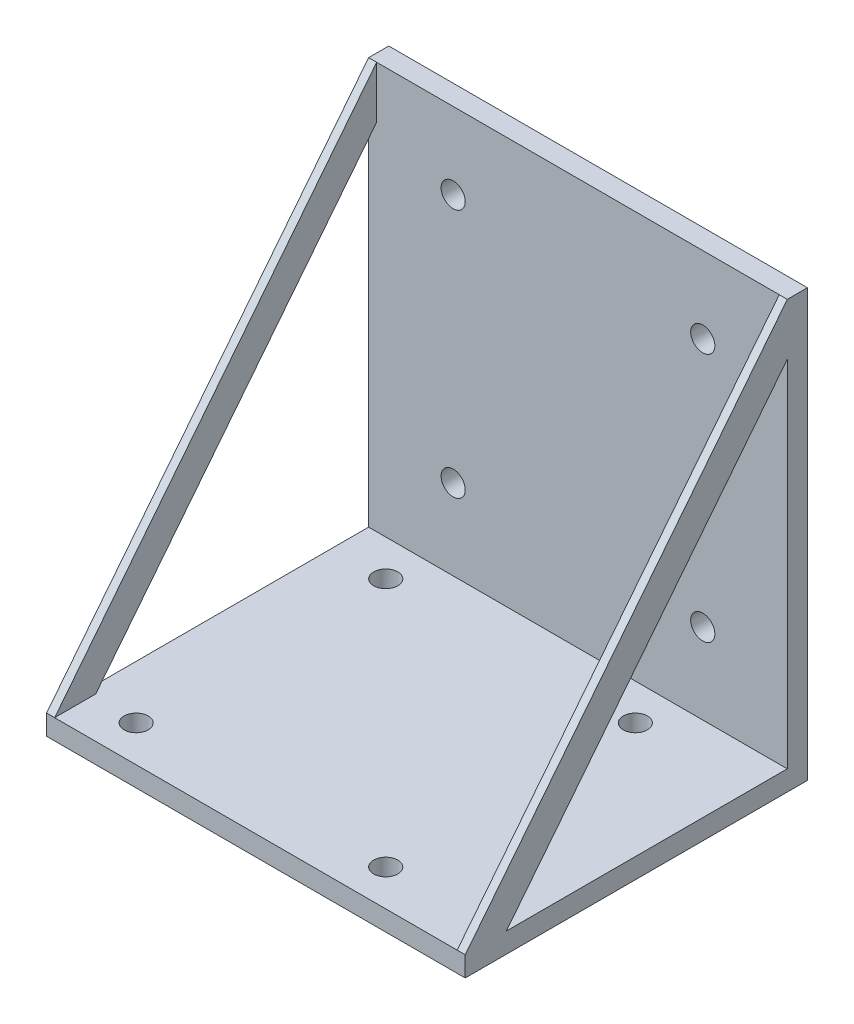
ISO-10303-21;
HEADER;
FILE_DESCRIPTION(('STEP AP214'),'2;1');
FILE_NAME('part.step','',(''),(''),'','','');
FILE_SCHEMA(('AUTOMOTIVE_DESIGN { 1 0 10303 214 1 1 1 1 }'));
ENDSEC;
DATA;
#1=APPLICATION_CONTEXT('core data for automotive mechanical design processes');
#2=APPLICATION_PROTOCOL_DEFINITION('international standard','automotive_design',2000,#1);
#3=PRODUCT_CONTEXT('',#1,'mechanical');
#4=PRODUCT('Part','Part','',(#3));
#5=PRODUCT_RELATED_PRODUCT_CATEGORY('part','',(#4));
#6=PRODUCT_DEFINITION_FORMATION('','',#4);
#7=PRODUCT_DEFINITION_CONTEXT('part definition',#1,'design');
#8=PRODUCT_DEFINITION('design','',#6,#7);
#9=PRODUCT_DEFINITION_SHAPE('','',#8);
#10=(LENGTH_UNIT() NAMED_UNIT(*) SI_UNIT(.MILLI.,.METRE.));
#11=(NAMED_UNIT(*) PLANE_ANGLE_UNIT() SI_UNIT($,.RADIAN.));
#12=(NAMED_UNIT(*) SI_UNIT($,.STERADIAN.) SOLID_ANGLE_UNIT());
#13=UNCERTAINTY_MEASURE_WITH_UNIT(LENGTH_MEASURE(1.E-05),#10,'distance_accuracy_value','');
#14=(GEOMETRIC_REPRESENTATION_CONTEXT(3) GLOBAL_UNCERTAINTY_ASSIGNED_CONTEXT((#13)) GLOBAL_UNIT_ASSIGNED_CONTEXT((#10,
#11,#12)) REPRESENTATION_CONTEXT('',''));
#15=CARTESIAN_POINT('',(0.,0.,0.));
#16=DIRECTION('',(0.,0.,1.));
#17=DIRECTION('',(1.,0.,0.));
#18=AXIS2_PLACEMENT_3D('',#15,#16,#17);
#19=CARTESIAN_POINT('',(0.,0.,2.5));
#20=DIRECTION('',(0.,0.,-1.));
#21=DIRECTION('',(-1.,0.,0.));
#22=AXIS2_PLACEMENT_3D('',#19,#20,#21);
#23=PLANE('',#22);
#24=CARTESIAN_POINT('',(-15.4999999999997,-15.5,2.5));
#25=DIRECTION('',(0.,0.,1.));
#26=DIRECTION('',(1.,0.,0.));
#27=AXIS2_PLACEMENT_3D('',#24,#25,#26);
#28=CIRCLE('',#27,1.5);
#29=CARTESIAN_POINT('',(-13.9999999999997,-15.5,2.5));
#30=VERTEX_POINT('',#29);
#31=EDGE_CURVE('E169',#30,#30,#28,.T.);
#32=ORIENTED_EDGE('',*,*,#31,.F.);
#33=EDGE_LOOP('',(#32));
#34=FACE_BOUND('',#33,.T.);
#35=CARTESIAN_POINT('',(15.5000000000003,-15.5,2.5));
#36=DIRECTION('',(0.,0.,1.));
#37=DIRECTION('',(1.,0.,0.));
#38=AXIS2_PLACEMENT_3D('',#35,#36,#37);
#39=CIRCLE('',#38,1.5);
#40=CARTESIAN_POINT('',(17.0000000000003,-15.5,2.5));
#41=VERTEX_POINT('',#40);
#42=EDGE_CURVE('E175',#41,#41,#39,.T.);
#43=ORIENTED_EDGE('',*,*,#42,.F.);
#44=EDGE_LOOP('',(#43));
#45=FACE_BOUND('',#44,.T.);
#46=CARTESIAN_POINT('',(15.5,15.5,2.5));
#47=DIRECTION('',(0.,0.,1.));
#48=DIRECTION('',(1.,0.,0.));
#49=AXIS2_PLACEMENT_3D('',#46,#47,#48);
#50=CIRCLE('',#49,1.5);
#51=CARTESIAN_POINT('',(17.,15.5,2.5));
#52=VERTEX_POINT('',#51);
#53=EDGE_CURVE('E181',#52,#52,#50,.T.);
#54=ORIENTED_EDGE('',*,*,#53,.F.);
#55=EDGE_LOOP('',(#54));
#56=FACE_BOUND('',#55,.T.);
#57=CARTESIAN_POINT('',(-15.5,15.5,2.5));
#58=DIRECTION('',(0.,0.,1.));
#59=DIRECTION('',(1.,0.,0.));
#60=AXIS2_PLACEMENT_3D('',#57,#58,#59);
#61=CIRCLE('',#60,1.5);
#62=CARTESIAN_POINT('',(-14.,15.5,2.5));
#63=VERTEX_POINT('',#62);
#64=EDGE_CURVE('E111',#63,#63,#61,.T.);
#65=ORIENTED_EDGE('',*,*,#64,.F.);
#66=EDGE_LOOP('',(#65));
#67=FACE_BOUND('',#66,.T.);
#68=DIRECTION('',(-1.,0.,0.));
#69=VECTOR('',#68,1.);
#70=CARTESIAN_POINT('',(-25.,-25.5,2.5));
#71=LINE('',#70,#69);
#72=CARTESIAN_POINT('',(26.,-25.5,2.5));
#73=VERTEX_POINT('',#72);
#74=CARTESIAN_POINT('',(-26.,-25.5,2.5));
#75=VERTEX_POINT('',#74);
#76=EDGE_CURVE('E157',#73,#75,#71,.T.);
#77=ORIENTED_EDGE('',*,*,#76,.F.);
#78=DIRECTION('',(0.,1.,0.));
#79=VECTOR('',#78,1.);
#80=CARTESIAN_POINT('',(26.,18.5577566019282,2.5));
#81=LINE('',#80,#79);
#82=CARTESIAN_POINT('',(26.,18.5577566019282,2.5));
#83=VERTEX_POINT('',#82);
#84=EDGE_CURVE('E237',#73,#83,#81,.T.);
#85=ORIENTED_EDGE('',*,*,#84,.T.);
#86=DIRECTION('',(-1.,0.,0.));
#87=VECTOR('',#86,1.);
#88=CARTESIAN_POINT('',(26.,18.5577566019282,2.5));
#89=LINE('',#88,#87);
#90=CARTESIAN_POINT('',(25.,18.5577566019282,2.5));
#91=VERTEX_POINT('',#90);
#92=EDGE_CURVE('E129',#83,#91,#89,.T.);
#93=ORIENTED_EDGE('',*,*,#92,.T.);
#94=DIRECTION('',(0.,1.,0.));
#95=VECTOR('',#94,1.);
#96=CARTESIAN_POINT('',(25.,-25.,2.5));
#97=LINE('',#96,#95);
#98=CARTESIAN_POINT('',(25.,25.,2.5));
#99=VERTEX_POINT('',#98);
#100=EDGE_CURVE('E191',#91,#99,#97,.T.);
#101=ORIENTED_EDGE('',*,*,#100,.T.);
#102=DIRECTION('',(-1.,0.,0.));
#103=VECTOR('',#102,1.);
#104=CARTESIAN_POINT('',(-25.,25.,2.5));
#105=LINE('',#104,#103);
#106=CARTESIAN_POINT('',(-25.,25.,2.5));
#107=VERTEX_POINT('',#106);
#108=EDGE_CURVE('E45',#99,#107,#105,.T.);
#109=ORIENTED_EDGE('',*,*,#108,.T.);
#110=DIRECTION('',(0.,-1.,0.));
#111=VECTOR('',#110,1.);
#112=CARTESIAN_POINT('',(-25.,-25.,2.5));
#113=LINE('',#112,#111);
#114=CARTESIAN_POINT('',(-25.,18.5577566019282,2.5));
#115=VERTEX_POINT('',#114);
#116=EDGE_CURVE('E11',#107,#115,#113,.T.);
#117=ORIENTED_EDGE('',*,*,#116,.T.);
#118=DIRECTION('',(1.,0.,0.));
#119=VECTOR('',#118,1.);
#120=CARTESIAN_POINT('',(-26.,18.5577566019282,2.5));
#121=LINE('',#120,#119);
#122=CARTESIAN_POINT('',(-26.,18.5577566019282,2.5));
#123=VERTEX_POINT('',#122);
#124=EDGE_CURVE('E230',#123,#115,#121,.T.);
#125=ORIENTED_EDGE('',*,*,#124,.F.);
#126=DIRECTION('',(0.,1.,0.));
#127=VECTOR('',#126,1.);
#128=CARTESIAN_POINT('',(-26.,18.5577566019282,2.5));
#129=LINE('',#128,#127);
#130=EDGE_CURVE('E341',#75,#123,#129,.T.);
#131=ORIENTED_EDGE('',*,*,#130,.F.);
#132=EDGE_LOOP('',(#77,#85,#93,#101,#109,#117,#125,#131));
#133=FACE_BOUND('',#132,.T.);
#134=ADVANCED_FACE('F36',(#34,#45,#56,#67,#133),#23,.F.);
#135=CARTESIAN_POINT('',(0.,0.,0.));
#136=DIRECTION('',(0.,0.,-1.));
#137=DIRECTION('',(-1.,0.,0.));
#138=AXIS2_PLACEMENT_3D('',#135,#136,#137);
#139=PLANE('',#138);
#140=CARTESIAN_POINT('',(15.5000000000003,-15.5,0.));
#141=DIRECTION('',(0.,0.,1.));
#142=DIRECTION('',(1.,0.,0.));
#143=AXIS2_PLACEMENT_3D('',#140,#141,#142);
#144=CIRCLE('',#143,1.5);
#145=CARTESIAN_POINT('',(17.0000000000003,-15.5,0.));
#146=VERTEX_POINT('',#145);
#147=EDGE_CURVE('E172',#146,#146,#144,.T.);
#148=ORIENTED_EDGE('',*,*,#147,.T.);
#149=EDGE_LOOP('',(#148));
#150=FACE_BOUND('',#149,.T.);
#151=CARTESIAN_POINT('',(-15.5,15.5,0.));
#152=DIRECTION('',(0.,0.,1.));
#153=DIRECTION('',(1.,0.,0.));
#154=AXIS2_PLACEMENT_3D('',#151,#152,#153);
#155=CIRCLE('',#154,1.5);
#156=CARTESIAN_POINT('',(-14.,15.5,0.));
#157=VERTEX_POINT('',#156);
#158=EDGE_CURVE('E184',#157,#157,#155,.T.);
#159=ORIENTED_EDGE('',*,*,#158,.T.);
#160=EDGE_LOOP('',(#159));
#161=FACE_BOUND('',#160,.T.);
#162=DIRECTION('',(-1.,0.,0.));
#163=VECTOR('',#162,1.);
#164=CARTESIAN_POINT('',(-25.,25.,0.));
#165=LINE('',#164,#163);
#166=CARTESIAN_POINT('',(26.,25.,0.));
#167=VERTEX_POINT('',#166);
#168=CARTESIAN_POINT('',(-26.,25.,0.));
#169=VERTEX_POINT('',#168);
#170=EDGE_CURVE('E98',#167,#169,#165,.T.);
#171=ORIENTED_EDGE('',*,*,#170,.F.);
#172=DIRECTION('',(0.,1.,0.));
#173=VECTOR('',#172,1.);
#174=CARTESIAN_POINT('',(26.,-28.,0.));
#175=LINE('',#174,#173);
#176=CARTESIAN_POINT('',(26.,-28.,0.));
#177=VERTEX_POINT('',#176);
#178=EDGE_CURVE('E103',#177,#167,#175,.T.);
#179=ORIENTED_EDGE('',*,*,#178,.F.);
#180=DIRECTION('',(1.,0.,0.));
#181=VECTOR('',#180,1.);
#182=CARTESIAN_POINT('',(-25.,-28.,0.));
#183=LINE('',#182,#181);
#184=CARTESIAN_POINT('',(-26.,-28.,0.));
#185=VERTEX_POINT('',#184);
#186=EDGE_CURVE('E40',#185,#177,#183,.T.);
#187=ORIENTED_EDGE('',*,*,#186,.F.);
#188=DIRECTION('',(0.,1.,0.));
#189=VECTOR('',#188,1.);
#190=CARTESIAN_POINT('',(-26.,25.,0.));
#191=LINE('',#190,#189);
#192=EDGE_CURVE('E106',#185,#169,#191,.T.);
#193=ORIENTED_EDGE('',*,*,#192,.T.);
#194=EDGE_LOOP('',(#171,#179,#187,#193));
#195=FACE_BOUND('',#194,.T.);
#196=CARTESIAN_POINT('',(15.5,15.5,0.));
#197=DIRECTION('',(0.,0.,1.));
#198=DIRECTION('',(1.,0.,0.));
#199=AXIS2_PLACEMENT_3D('',#196,#197,#198);
#200=CIRCLE('',#199,1.5);
#201=CARTESIAN_POINT('',(17.,15.5,0.));
#202=VERTEX_POINT('',#201);
#203=EDGE_CURVE('E178',#202,#202,#200,.T.);
#204=ORIENTED_EDGE('',*,*,#203,.T.);
#205=EDGE_LOOP('',(#204));
#206=FACE_BOUND('',#205,.T.);
#207=CARTESIAN_POINT('',(-15.4999999999997,-15.5,0.));
#208=DIRECTION('',(0.,0.,1.));
#209=DIRECTION('',(1.,0.,0.));
#210=AXIS2_PLACEMENT_3D('',#207,#208,#209);
#211=CIRCLE('',#210,1.5);
#212=CARTESIAN_POINT('',(-13.9999999999997,-15.5,0.));
#213=VERTEX_POINT('',#212);
#214=EDGE_CURVE('E168',#213,#213,#211,.T.);
#215=ORIENTED_EDGE('',*,*,#214,.T.);
#216=EDGE_LOOP('',(#215));
#217=FACE_BOUND('',#216,.T.);
#218=ADVANCED_FACE('F100',(#150,#161,#195,#206,#217),#139,.T.);
#219=CARTESIAN_POINT('',(-25.,25.,2.5));
#220=DIRECTION('',(0.,-1.,0.));
#221=DIRECTION('',(0.,0.,-1.));
#222=AXIS2_PLACEMENT_3D('',#219,#220,#221);
#223=PLANE('',#222);
#224=ORIENTED_EDGE('',*,*,#170,.T.);
#225=DIRECTION('',(0.,0.,1.));
#226=VECTOR('',#225,1.);
#227=CARTESIAN_POINT('',(-26.,25.,2.5));
#228=LINE('',#227,#226);
#229=CARTESIAN_POINT('',(-26.,25.,2.5));
#230=VERTEX_POINT('',#229);
#231=EDGE_CURVE('E211',#169,#230,#228,.T.);
#232=ORIENTED_EDGE('',*,*,#231,.T.);
#233=DIRECTION('',(1.,0.,0.));
#234=VECTOR('',#233,1.);
#235=CARTESIAN_POINT('',(-26.,25.,2.5));
#236=LINE('',#235,#234);
#237=EDGE_CURVE('E208',#230,#107,#236,.T.);
#238=ORIENTED_EDGE('',*,*,#237,.T.);
#239=ORIENTED_EDGE('',*,*,#108,.F.);
#240=DIRECTION('',(-1.,0.,0.));
#241=VECTOR('',#240,1.);
#242=CARTESIAN_POINT('',(26.,25.,2.5));
#243=LINE('',#242,#241);
#244=CARTESIAN_POINT('',(26.,25.,2.5));
#245=VERTEX_POINT('',#244);
#246=EDGE_CURVE('E120',#245,#99,#243,.T.);
#247=ORIENTED_EDGE('',*,*,#246,.F.);
#248=DIRECTION('',(0.,0.,1.));
#249=VECTOR('',#248,1.);
#250=CARTESIAN_POINT('',(26.,25.,2.5));
#251=LINE('',#250,#249);
#252=EDGE_CURVE('E115',#167,#245,#251,.T.);
#253=ORIENTED_EDGE('',*,*,#252,.F.);
#254=EDGE_LOOP('',(#224,#232,#238,#239,#247,#253));
#255=FACE_BOUND('',#254,.T.);
#256=ADVANCED_FACE('F38',(#255),#223,.F.);
#257=CARTESIAN_POINT('',(-25.,-28.,2.5));
#258=DIRECTION('',(0.,1.,0.));
#259=DIRECTION('',(0.,0.,1.));
#260=AXIS2_PLACEMENT_3D('',#257,#258,#259);
#261=PLANE('',#260);
#262=CARTESIAN_POINT('',(11.625,-28.,7.));
#263=DIRECTION('',(0.,1.,0.));
#264=DIRECTION('',(0.,0.,1.));
#265=AXIS2_PLACEMENT_3D('',#262,#263,#264);
#266=CIRCLE('',#265,1.5);
#267=CARTESIAN_POINT('',(11.625,-28.,8.5));
#268=VERTEX_POINT('',#267);
#269=EDGE_CURVE('E148',#268,#268,#266,.T.);
#270=ORIENTED_EDGE('',*,*,#269,.T.);
#271=EDGE_LOOP('',(#270));
#272=FACE_BOUND('',#271,.T.);
#273=CARTESIAN_POINT('',(11.6250000000003,-28.,38.));
#274=DIRECTION('',(0.,1.,0.));
#275=DIRECTION('',(0.,0.,1.));
#276=AXIS2_PLACEMENT_3D('',#273,#274,#275);
#277=CIRCLE('',#276,1.5);
#278=CARTESIAN_POINT('',(11.6250000000003,-28.,39.5));
#279=VERTEX_POINT('',#278);
#280=EDGE_CURVE('E145',#279,#279,#277,.T.);
#281=ORIENTED_EDGE('',*,*,#280,.T.);
#282=EDGE_LOOP('',(#281));
#283=FACE_BOUND('',#282,.T.);
#284=CARTESIAN_POINT('',(-19.3749999999997,-28.,38.));
#285=DIRECTION('',(0.,1.,0.));
#286=DIRECTION('',(0.,0.,1.));
#287=AXIS2_PLACEMENT_3D('',#284,#285,#286);
#288=CIRCLE('',#287,1.5);
#289=CARTESIAN_POINT('',(-19.3749999999997,-28.,39.5));
#290=VERTEX_POINT('',#289);
#291=EDGE_CURVE('E137',#290,#290,#288,.T.);
#292=ORIENTED_EDGE('',*,*,#291,.T.);
#293=EDGE_LOOP('',(#292));
#294=FACE_BOUND('',#293,.T.);
#295=CARTESIAN_POINT('',(-19.375,-28.,7.));
#296=DIRECTION('',(0.,1.,0.));
#297=DIRECTION('',(0.,0.,1.));
#298=AXIS2_PLACEMENT_3D('',#295,#296,#297);
#299=CIRCLE('',#298,1.5);
#300=CARTESIAN_POINT('',(-19.375,-28.,8.5));
#301=VERTEX_POINT('',#300);
#302=EDGE_CURVE('E154',#301,#301,#299,.T.);
#303=ORIENTED_EDGE('',*,*,#302,.T.);
#304=EDGE_LOOP('',(#303));
#305=FACE_BOUND('',#304,.T.);
#306=ORIENTED_EDGE('',*,*,#186,.T.);
#307=DIRECTION('',(0.,0.,-1.));
#308=VECTOR('',#307,1.);
#309=CARTESIAN_POINT('',(26.,-28.,39.3431457505076));
#310=LINE('',#309,#308);
#311=CARTESIAN_POINT('',(26.,-28.,42.5));
#312=VERTEX_POINT('',#311);
#313=EDGE_CURVE('E117',#312,#177,#310,.T.);
#314=ORIENTED_EDGE('',*,*,#313,.F.);
#315=DIRECTION('',(1.,0.,0.));
#316=VECTOR('',#315,1.);
#317=CARTESIAN_POINT('',(-25.,-28.,42.5));
#318=LINE('',#317,#316);
#319=CARTESIAN_POINT('',(-26.,-28.,42.5));
#320=VERTEX_POINT('',#319);
#321=EDGE_CURVE('E86',#320,#312,#318,.T.);
#322=ORIENTED_EDGE('',*,*,#321,.F.);
#323=DIRECTION('',(0.,0.,-1.));
#324=VECTOR('',#323,1.);
#325=CARTESIAN_POINT('',(-26.,-28.,39.3431457505076));
#326=LINE('',#325,#324);
#327=EDGE_CURVE('E216',#320,#185,#326,.T.);
#328=ORIENTED_EDGE('',*,*,#327,.T.);
#329=EDGE_LOOP('',(#306,#314,#322,#328));
#330=FACE_BOUND('',#329,.T.);
#331=ADVANCED_FACE('F313',(#272,#283,#294,#305,#330),#261,.F.);
#332=CARTESIAN_POINT('',(-15.5,15.5,2.5));
#333=DIRECTION('',(0.,0.,-1.));
#334=DIRECTION('',(-1.,0.,0.));
#335=AXIS2_PLACEMENT_3D('',#332,#333,#334);
#336=CYLINDRICAL_SURFACE('',#335,1.5);
#337=ORIENTED_EDGE('',*,*,#64,.T.);
#338=EDGE_LOOP('',(#337));
#339=FACE_BOUND('',#338,.T.);
#340=ORIENTED_EDGE('',*,*,#158,.F.);
#341=EDGE_LOOP('',(#340));
#342=FACE_BOUND('',#341,.T.);
#343=ADVANCED_FACE('F311',(#339,#342),#336,.F.);
#344=CARTESIAN_POINT('',(15.5,15.5,2.5));
#345=DIRECTION('',(0.,0.,-1.));
#346=DIRECTION('',(-1.,0.,0.));
#347=AXIS2_PLACEMENT_3D('',#344,#345,#346);
#348=CYLINDRICAL_SURFACE('',#347,1.5);
#349=ORIENTED_EDGE('',*,*,#53,.T.);
#350=EDGE_LOOP('',(#349));
#351=FACE_BOUND('',#350,.T.);
#352=ORIENTED_EDGE('',*,*,#203,.F.);
#353=EDGE_LOOP('',(#352));
#354=FACE_BOUND('',#353,.T.);
#355=ADVANCED_FACE('F320',(#351,#354),#348,.F.);
#356=CARTESIAN_POINT('',(15.5000000000003,-15.5,2.5));
#357=DIRECTION('',(0.,0.,-1.));
#358=DIRECTION('',(-1.,0.,0.));
#359=AXIS2_PLACEMENT_3D('',#356,#357,#358);
#360=CYLINDRICAL_SURFACE('',#359,1.5);
#361=ORIENTED_EDGE('',*,*,#42,.T.);
#362=EDGE_LOOP('',(#361));
#363=FACE_BOUND('',#362,.T.);
#364=ORIENTED_EDGE('',*,*,#147,.F.);
#365=EDGE_LOOP('',(#364));
#366=FACE_BOUND('',#365,.T.);
#367=ADVANCED_FACE('F390',(#363,#366),#360,.F.);
#368=CARTESIAN_POINT('',(-15.4999999999997,-15.5,2.5));
#369=DIRECTION('',(0.,0.,-1.));
#370=DIRECTION('',(-1.,0.,0.));
#371=AXIS2_PLACEMENT_3D('',#368,#369,#370);
#372=CYLINDRICAL_SURFACE('',#371,1.5);
#373=ORIENTED_EDGE('',*,*,#31,.T.);
#374=EDGE_LOOP('',(#373));
#375=FACE_BOUND('',#374,.T.);
#376=ORIENTED_EDGE('',*,*,#214,.F.);
#377=EDGE_LOOP('',(#376));
#378=FACE_BOUND('',#377,.T.);
#379=ADVANCED_FACE('F386',(#375,#378),#372,.F.);
#380=CARTESIAN_POINT('',(-25.,-25.5,42.5));
#381=DIRECTION('',(0.,-1.,0.));
#382=DIRECTION('',(0.,0.,-1.));
#383=AXIS2_PLACEMENT_3D('',#380,#381,#382);
#384=PLANE('',#383);
#385=CARTESIAN_POINT('',(11.625,-25.5,7.));
#386=DIRECTION('',(0.,1.,0.));
#387=DIRECTION('',(0.,0.,1.));
#388=AXIS2_PLACEMENT_3D('',#385,#386,#387);
#389=CIRCLE('',#388,1.5);
#390=CARTESIAN_POINT('',(11.625,-25.5,8.5));
#391=VERTEX_POINT('',#390);
#392=EDGE_CURVE('E134',#391,#391,#389,.T.);
#393=ORIENTED_EDGE('',*,*,#392,.F.);
#394=EDGE_LOOP('',(#393));
#395=FACE_BOUND('',#394,.T.);
#396=CARTESIAN_POINT('',(11.6250000000003,-25.5,38.));
#397=DIRECTION('',(0.,1.,0.));
#398=DIRECTION('',(0.,0.,1.));
#399=AXIS2_PLACEMENT_3D('',#396,#397,#398);
#400=CIRCLE('',#399,1.5);
#401=CARTESIAN_POINT('',(11.6250000000003,-25.5,39.5));
#402=VERTEX_POINT('',#401);
#403=EDGE_CURVE('E138',#402,#402,#400,.T.);
#404=ORIENTED_EDGE('',*,*,#403,.F.);
#405=EDGE_LOOP('',(#404));
#406=FACE_BOUND('',#405,.T.);
#407=CARTESIAN_POINT('',(-19.3749999999997,-25.5,38.));
#408=DIRECTION('',(0.,1.,0.));
#409=DIRECTION('',(0.,0.,1.));
#410=AXIS2_PLACEMENT_3D('',#407,#408,#409);
#411=CIRCLE('',#410,1.5);
#412=CARTESIAN_POINT('',(-19.3749999999997,-25.5,39.5));
#413=VERTEX_POINT('',#412);
#414=EDGE_CURVE('E133',#413,#413,#411,.T.);
#415=ORIENTED_EDGE('',*,*,#414,.F.);
#416=EDGE_LOOP('',(#415));
#417=FACE_BOUND('',#416,.T.);
#418=CARTESIAN_POINT('',(-19.375,-25.5,7.));
#419=DIRECTION('',(0.,1.,0.));
#420=DIRECTION('',(0.,0.,1.));
#421=AXIS2_PLACEMENT_3D('',#418,#419,#420);
#422=CIRCLE('',#421,1.5);
#423=CARTESIAN_POINT('',(-19.375,-25.5,8.5));
#424=VERTEX_POINT('',#423);
#425=EDGE_CURVE('E151',#424,#424,#422,.T.);
#426=ORIENTED_EDGE('',*,*,#425,.F.);
#427=EDGE_LOOP('',(#426));
#428=FACE_BOUND('',#427,.T.);
#429=ORIENTED_EDGE('',*,*,#76,.T.);
#430=DIRECTION('',(0.,0.,-1.));
#431=VECTOR('',#430,1.);
#432=CARTESIAN_POINT('',(-26.,-25.5,2.5));
#433=LINE('',#432,#431);
#434=CARTESIAN_POINT('',(-26.,-25.5,37.3972329520223));
#435=VERTEX_POINT('',#434);
#436=EDGE_CURVE('E344',#435,#75,#433,.T.);
#437=ORIENTED_EDGE('',*,*,#436,.F.);
#438=DIRECTION('',(1.,0.,0.));
#439=VECTOR('',#438,1.);
#440=CARTESIAN_POINT('',(-26.,-25.5,37.3972329520223));
#441=LINE('',#440,#439);
#442=CARTESIAN_POINT('',(-25.,-25.5,37.3972329520223));
#443=VERTEX_POINT('',#442);
#444=EDGE_CURVE('E225',#435,#443,#441,.T.);
#445=ORIENTED_EDGE('',*,*,#444,.T.);
#446=DIRECTION('',(0.,0.,-1.));
#447=VECTOR('',#446,1.);
#448=CARTESIAN_POINT('',(-25.,-25.5,42.5));
#449=LINE('',#448,#447);
#450=CARTESIAN_POINT('',(-25.,-25.5,42.5));
#451=VERTEX_POINT('',#450);
#452=EDGE_CURVE('E162',#451,#443,#449,.T.);
#453=ORIENTED_EDGE('',*,*,#452,.F.);
#454=DIRECTION('',(-1.,0.,0.));
#455=VECTOR('',#454,1.);
#456=CARTESIAN_POINT('',(-25.,-25.5,42.5));
#457=LINE('',#456,#455);
#458=CARTESIAN_POINT('',(25.,-25.5,42.5));
#459=VERTEX_POINT('',#458);
#460=EDGE_CURVE('E159',#459,#451,#457,.T.);
#461=ORIENTED_EDGE('',*,*,#460,.F.);
#462=DIRECTION('',(0.,0.,-1.));
#463=VECTOR('',#462,1.);
#464=CARTESIAN_POINT('',(25.,-25.5,42.5));
#465=LINE('',#464,#463);
#466=CARTESIAN_POINT('',(25.,-25.5,37.3972329520223));
#467=VERTEX_POINT('',#466);
#468=EDGE_CURVE('E77',#459,#467,#465,.T.);
#469=ORIENTED_EDGE('',*,*,#468,.T.);
#470=DIRECTION('',(-1.,0.,0.));
#471=VECTOR('',#470,1.);
#472=CARTESIAN_POINT('',(26.,-25.5,37.3972329520223));
#473=LINE('',#472,#471);
#474=CARTESIAN_POINT('',(26.,-25.5,37.3972329520223));
#475=VERTEX_POINT('',#474);
#476=EDGE_CURVE('E53',#475,#467,#473,.T.);
#477=ORIENTED_EDGE('',*,*,#476,.F.);
#478=DIRECTION('',(0.,0.,-1.));
#479=VECTOR('',#478,1.);
#480=CARTESIAN_POINT('',(26.,-25.5,2.5));
#481=LINE('',#480,#479);
#482=EDGE_CURVE('E242',#475,#73,#481,.T.);
#483=ORIENTED_EDGE('',*,*,#482,.T.);
#484=EDGE_LOOP('',(#429,#437,#445,#453,#461,#469,#477,#483));
#485=FACE_BOUND('',#484,.T.);
#486=ADVANCED_FACE('F251',(#395,#406,#417,#428,#485),#384,.F.);
#487=CARTESIAN_POINT('',(0.,0.,42.5));
#488=DIRECTION('',(0.,0.,-1.));
#489=DIRECTION('',(-1.,0.,0.));
#490=AXIS2_PLACEMENT_3D('',#487,#488,#489);
#491=PLANE('',#490);
#492=ORIENTED_EDGE('',*,*,#460,.T.);
#493=DIRECTION('',(1.,0.,0.));
#494=VECTOR('',#493,1.);
#495=CARTESIAN_POINT('',(-26.,-25.5,42.5));
#496=LINE('',#495,#494);
#497=CARTESIAN_POINT('',(-26.,-25.5,42.5));
#498=VERTEX_POINT('',#497);
#499=EDGE_CURVE('E215',#498,#451,#496,.T.);
#500=ORIENTED_EDGE('',*,*,#499,.F.);
#501=DIRECTION('',(0.,-1.,0.));
#502=VECTOR('',#501,1.);
#503=CARTESIAN_POINT('',(-26.,-28.,42.5));
#504=LINE('',#503,#502);
#505=EDGE_CURVE('E224',#498,#320,#504,.T.);
#506=ORIENTED_EDGE('',*,*,#505,.T.);
#507=ORIENTED_EDGE('',*,*,#321,.T.);
#508=DIRECTION('',(0.,-1.,0.));
#509=VECTOR('',#508,1.);
#510=CARTESIAN_POINT('',(26.,-28.,42.5));
#511=LINE('',#510,#509);
#512=CARTESIAN_POINT('',(26.,-25.5,42.5));
#513=VERTEX_POINT('',#512);
#514=EDGE_CURVE('E128',#513,#312,#511,.T.);
#515=ORIENTED_EDGE('',*,*,#514,.F.);
#516=DIRECTION('',(-1.,0.,0.));
#517=VECTOR('',#516,1.);
#518=CARTESIAN_POINT('',(26.,-25.5,42.5));
#519=LINE('',#518,#517);
#520=EDGE_CURVE('E122',#513,#459,#519,.T.);
#521=ORIENTED_EDGE('',*,*,#520,.T.);
#522=EDGE_LOOP('',(#492,#500,#506,#507,#515,#521));
#523=FACE_BOUND('',#522,.T.);
#524=ADVANCED_FACE('F247',(#523),#491,.F.);
#525=CARTESIAN_POINT('',(-19.375,-65.5,7.));
#526=DIRECTION('',(0.,1.,0.));
#527=DIRECTION('',(0.,0.,1.));
#528=AXIS2_PLACEMENT_3D('',#525,#526,#527);
#529=CYLINDRICAL_SURFACE('',#528,1.5);
#530=ORIENTED_EDGE('',*,*,#425,.T.);
#531=EDGE_LOOP('',(#530));
#532=FACE_BOUND('',#531,.T.);
#533=ORIENTED_EDGE('',*,*,#302,.F.);
#534=EDGE_LOOP('',(#533));
#535=FACE_BOUND('',#534,.T.);
#536=ADVANCED_FACE('F377',(#532,#535),#529,.F.);
#537=CARTESIAN_POINT('',(-19.3749999999997,-65.5,38.));
#538=DIRECTION('',(0.,1.,0.));
#539=DIRECTION('',(0.,0.,1.));
#540=AXIS2_PLACEMENT_3D('',#537,#538,#539);
#541=CYLINDRICAL_SURFACE('',#540,1.5);
#542=ORIENTED_EDGE('',*,*,#414,.T.);
#543=EDGE_LOOP('',(#542));
#544=FACE_BOUND('',#543,.T.);
#545=ORIENTED_EDGE('',*,*,#291,.F.);
#546=EDGE_LOOP('',(#545));
#547=FACE_BOUND('',#546,.T.);
#548=ADVANCED_FACE('F373',(#544,#547),#541,.F.);
#549=CARTESIAN_POINT('',(11.6250000000003,-65.5,38.));
#550=DIRECTION('',(0.,1.,0.));
#551=DIRECTION('',(0.,0.,1.));
#552=AXIS2_PLACEMENT_3D('',#549,#550,#551);
#553=CYLINDRICAL_SURFACE('',#552,1.5);
#554=ORIENTED_EDGE('',*,*,#403,.T.);
#555=EDGE_LOOP('',(#554));
#556=FACE_BOUND('',#555,.T.);
#557=ORIENTED_EDGE('',*,*,#280,.F.);
#558=EDGE_LOOP('',(#557));
#559=FACE_BOUND('',#558,.T.);
#560=ADVANCED_FACE('F296',(#556,#559),#553,.F.);
#561=CARTESIAN_POINT('',(11.625,-65.5,7.));
#562=DIRECTION('',(0.,1.,0.));
#563=DIRECTION('',(0.,0.,1.));
#564=AXIS2_PLACEMENT_3D('',#561,#562,#563);
#565=CYLINDRICAL_SURFACE('',#564,1.5);
#566=ORIENTED_EDGE('',*,*,#392,.T.);
#567=EDGE_LOOP('',(#566));
#568=FACE_BOUND('',#567,.T.);
#569=ORIENTED_EDGE('',*,*,#269,.F.);
#570=EDGE_LOOP('',(#569));
#571=FACE_BOUND('',#570,.T.);
#572=ADVANCED_FACE('F288',(#568,#571),#565,.F.);
#573=CARTESIAN_POINT('',(25.,0.,0.));
#574=DIRECTION('',(-1.,0.,0.));
#575=DIRECTION('',(0.,0.,1.));
#576=AXIS2_PLACEMENT_3D('',#573,#574,#575);
#577=PLANE('',#576);
#578=ORIENTED_EDGE('',*,*,#100,.F.);
#579=DIRECTION('',(0.,-0.78388842022198,0.620901718987707));
#580=VECTOR('',#579,1.);
#581=CARTESIAN_POINT('',(25.,18.5577566019282,2.5));
#582=LINE('',#581,#580);
#583=EDGE_CURVE('E236',#91,#467,#582,.T.);
#584=ORIENTED_EDGE('',*,*,#583,.T.);
#585=ORIENTED_EDGE('',*,*,#468,.F.);
#586=DIRECTION('',(0.,-0.78388842022198,0.620901718987707));
#587=VECTOR('',#586,1.);
#588=CARTESIAN_POINT('',(25.,-25.5,42.5));
#589=LINE('',#588,#587);
#590=EDGE_CURVE('E126',#99,#459,#589,.T.);
#591=ORIENTED_EDGE('',*,*,#590,.F.);
#592=EDGE_LOOP('',(#578,#584,#585,#591));
#593=FACE_BOUND('',#592,.T.);
#594=ADVANCED_FACE('F286',(#593),#577,.T.);
#595=CARTESIAN_POINT('',(26.,0.,0.));
#596=DIRECTION('',(-1.,0.,0.));
#597=DIRECTION('',(0.,0.,1.));
#598=AXIS2_PLACEMENT_3D('',#595,#596,#597);
#599=PLANE('',#598);
#600=ORIENTED_EDGE('',*,*,#514,.T.);
#601=ORIENTED_EDGE('',*,*,#313,.T.);
#602=ORIENTED_EDGE('',*,*,#178,.T.);
#603=ORIENTED_EDGE('',*,*,#252,.T.);
#604=DIRECTION('',(0.,-0.78388842022198,0.620901718987707));
#605=VECTOR('',#604,1.);
#606=CARTESIAN_POINT('',(26.,-25.5,42.5));
#607=LINE('',#606,#605);
#608=EDGE_CURVE('E62',#245,#513,#607,.T.);
#609=ORIENTED_EDGE('',*,*,#608,.T.);
#610=EDGE_LOOP('',(#600,#601,#602,#603,#609));
#611=FACE_BOUND('',#610,.T.);
#612=ORIENTED_EDGE('',*,*,#84,.F.);
#613=ORIENTED_EDGE('',*,*,#482,.F.);
#614=DIRECTION('',(0.,-0.78388842022198,0.620901718987707));
#615=VECTOR('',#614,1.);
#616=CARTESIAN_POINT('',(26.,18.5577566019282,2.5));
#617=LINE('',#616,#615);
#618=EDGE_CURVE('E240',#83,#475,#617,.T.);
#619=ORIENTED_EDGE('',*,*,#618,.F.);
#620=EDGE_LOOP('',(#612,#613,#619));
#621=FACE_BOUND('',#620,.T.);
#622=ADVANCED_FACE('F113',(#611,#621),#599,.F.);
#623=CARTESIAN_POINT('',(26.,-25.5,42.5));
#624=DIRECTION('',(0.,-0.620901718987707,-0.78388842022198));
#625=DIRECTION('',(0.,0.78388842022198,-0.620901718987707));
#626=AXIS2_PLACEMENT_3D('',#623,#624,#625);
#627=PLANE('',#626);
#628=ORIENTED_EDGE('',*,*,#590,.T.);
#629=ORIENTED_EDGE('',*,*,#520,.F.);
#630=ORIENTED_EDGE('',*,*,#608,.F.);
#631=ORIENTED_EDGE('',*,*,#246,.T.);
#632=EDGE_LOOP('',(#628,#629,#630,#631));
#633=FACE_BOUND('',#632,.T.);
#634=ADVANCED_FACE('F294',(#633),#627,.F.);
#635=CARTESIAN_POINT('',(26.,18.5577566019282,2.5));
#636=DIRECTION('',(0.,-0.620901718987707,-0.78388842022198));
#637=DIRECTION('',(0.,0.78388842022198,-0.620901718987707));
#638=AXIS2_PLACEMENT_3D('',#635,#636,#637);
#639=PLANE('',#638);
#640=ORIENTED_EDGE('',*,*,#583,.F.);
#641=ORIENTED_EDGE('',*,*,#92,.F.);
#642=ORIENTED_EDGE('',*,*,#618,.T.);
#643=ORIENTED_EDGE('',*,*,#476,.T.);
#644=EDGE_LOOP('',(#640,#641,#642,#643));
#645=FACE_BOUND('',#644,.T.);
#646=ADVANCED_FACE('F282',(#645),#639,.T.);
#647=CARTESIAN_POINT('',(-26.,-25.5,42.5));
#648=DIRECTION('',(0.,0.620901718987707,0.78388842022198));
#649=DIRECTION('',(0.,-0.78388842022198,0.620901718987707));
#650=AXIS2_PLACEMENT_3D('',#647,#648,#649);
#651=PLANE('',#650);
#652=DIRECTION('',(0.,-0.78388842022198,0.620901718987707));
#653=VECTOR('',#652,1.);
#654=CARTESIAN_POINT('',(-25.,-25.5,42.5));
#655=LINE('',#654,#653);
#656=EDGE_CURVE('E220',#107,#451,#655,.T.);
#657=ORIENTED_EDGE('',*,*,#656,.F.);
#658=ORIENTED_EDGE('',*,*,#237,.F.);
#659=DIRECTION('',(0.,-0.78388842022198,0.620901718987707));
#660=VECTOR('',#659,1.);
#661=CARTESIAN_POINT('',(-26.,-25.5,42.5));
#662=LINE('',#661,#660);
#663=EDGE_CURVE('E227',#230,#498,#662,.T.);
#664=ORIENTED_EDGE('',*,*,#663,.T.);
#665=ORIENTED_EDGE('',*,*,#499,.T.);
#666=EDGE_LOOP('',(#657,#658,#664,#665));
#667=FACE_BOUND('',#666,.T.);
#668=ADVANCED_FACE('F221',(#667),#651,.T.);
#669=CARTESIAN_POINT('',(-26.,0.,0.));
#670=DIRECTION('',(1.,0.,0.));
#671=DIRECTION('',(0.,0.,1.));
#672=AXIS2_PLACEMENT_3D('',#669,#670,#671);
#673=PLANE('',#672);
#674=ORIENTED_EDGE('',*,*,#436,.T.);
#675=ORIENTED_EDGE('',*,*,#130,.T.);
#676=DIRECTION('',(0.,-0.78388842022198,0.620901718987707));
#677=VECTOR('',#676,1.);
#678=CARTESIAN_POINT('',(-26.,18.5577566019282,2.5));
#679=LINE('',#678,#677);
#680=EDGE_CURVE('E339',#123,#435,#679,.T.);
#681=ORIENTED_EDGE('',*,*,#680,.T.);
#682=EDGE_LOOP('',(#674,#675,#681));
#683=FACE_BOUND('',#682,.T.);
#684=ORIENTED_EDGE('',*,*,#505,.F.);
#685=ORIENTED_EDGE('',*,*,#663,.F.);
#686=ORIENTED_EDGE('',*,*,#231,.F.);
#687=ORIENTED_EDGE('',*,*,#192,.F.);
#688=ORIENTED_EDGE('',*,*,#327,.F.);
#689=EDGE_LOOP('',(#684,#685,#686,#687,#688));
#690=FACE_BOUND('',#689,.T.);
#691=ADVANCED_FACE('F334',(#683,#690),#673,.F.);
#692=CARTESIAN_POINT('',(-25.,0.,0.));
#693=DIRECTION('',(1.,0.,0.));
#694=DIRECTION('',(0.,0.,1.));
#695=AXIS2_PLACEMENT_3D('',#692,#693,#694);
#696=PLANE('',#695);
#697=ORIENTED_EDGE('',*,*,#656,.T.);
#698=ORIENTED_EDGE('',*,*,#452,.T.);
#699=DIRECTION('',(0.,-0.78388842022198,0.620901718987707));
#700=VECTOR('',#699,1.);
#701=CARTESIAN_POINT('',(-25.,18.5577566019282,2.5));
#702=LINE('',#701,#700);
#703=EDGE_CURVE('E260',#115,#443,#702,.T.);
#704=ORIENTED_EDGE('',*,*,#703,.F.);
#705=ORIENTED_EDGE('',*,*,#116,.F.);
#706=EDGE_LOOP('',(#697,#698,#704,#705));
#707=FACE_BOUND('',#706,.T.);
#708=ADVANCED_FACE('F259',(#707),#696,.T.);
#709=CARTESIAN_POINT('',(-26.,18.5577566019282,2.5));
#710=DIRECTION('',(0.,0.620901718987707,0.78388842022198));
#711=DIRECTION('',(0.,-0.78388842022198,0.620901718987707));
#712=AXIS2_PLACEMENT_3D('',#709,#710,#711);
#713=PLANE('',#712);
#714=ORIENTED_EDGE('',*,*,#703,.T.);
#715=ORIENTED_EDGE('',*,*,#444,.F.);
#716=ORIENTED_EDGE('',*,*,#680,.F.);
#717=ORIENTED_EDGE('',*,*,#124,.T.);
#718=EDGE_LOOP('',(#714,#715,#716,#717));
#719=FACE_BOUND('',#718,.T.);
#720=ADVANCED_FACE('F352',(#719),#713,.F.);
#721=CLOSED_SHELL('',(#134,#218,#256,#331,#343,#355,#367,#379,#486,#524,#536,#548,#560,#572,
#594,#622,#634,#646,#668,#691,#708,#720));
#722=MANIFOLD_SOLID_BREP('B2',#721);
#723=ADVANCED_BREP_SHAPE_REPRESENTATION('',(#18,#722),#14);
#724=SHAPE_DEFINITION_REPRESENTATION(#9,#723);
ENDSEC;
END-ISO-10303-21;
